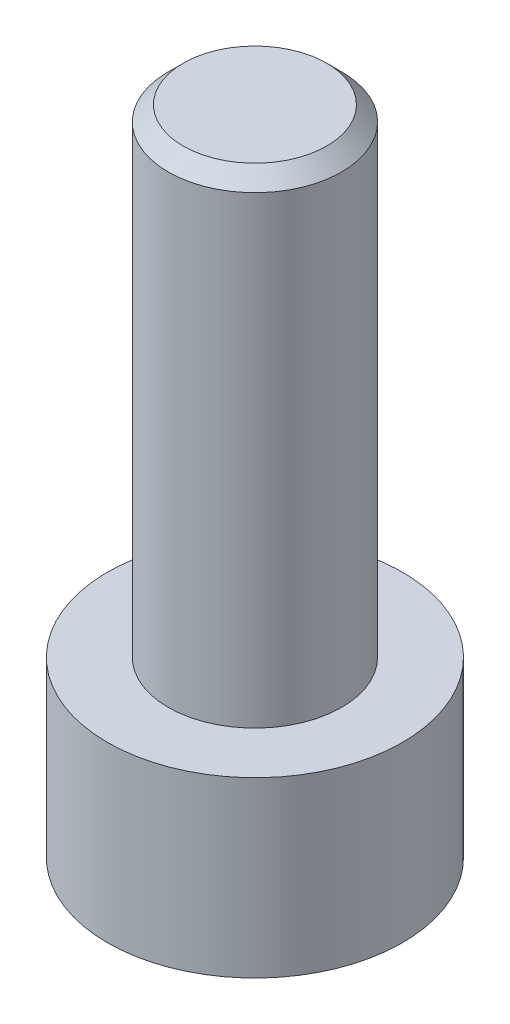
ISO-10303-21;
HEADER;
FILE_DESCRIPTION(('STEP AP214'),'2;1');
FILE_NAME('part.step','',(''),(''),'','','');
FILE_SCHEMA(('AUTOMOTIVE_DESIGN { 1 0 10303 214 1 1 1 1 }'));
ENDSEC;
DATA;
#1=APPLICATION_CONTEXT('core data for automotive mechanical design processes');
#2=APPLICATION_PROTOCOL_DEFINITION('international standard','automotive_design',2000,#1);
#3=PRODUCT_CONTEXT('',#1,'mechanical');
#4=PRODUCT('Part','Part','',(#3));
#5=PRODUCT_RELATED_PRODUCT_CATEGORY('part','',(#4));
#6=PRODUCT_DEFINITION_FORMATION('','',#4);
#7=PRODUCT_DEFINITION_CONTEXT('part definition',#1,'design');
#8=PRODUCT_DEFINITION('design','',#6,#7);
#9=PRODUCT_DEFINITION_SHAPE('','',#8);
#10=(LENGTH_UNIT() NAMED_UNIT(*) SI_UNIT(.MILLI.,.METRE.));
#11=(NAMED_UNIT(*) PLANE_ANGLE_UNIT() SI_UNIT($,.RADIAN.));
#12=(NAMED_UNIT(*) SI_UNIT($,.STERADIAN.) SOLID_ANGLE_UNIT());
#13=UNCERTAINTY_MEASURE_WITH_UNIT(LENGTH_MEASURE(1.E-05),#10,'distance_accuracy_value','');
#14=(GEOMETRIC_REPRESENTATION_CONTEXT(3) GLOBAL_UNCERTAINTY_ASSIGNED_CONTEXT((#13)) GLOBAL_UNIT_ASSIGNED_CONTEXT((#10,
#11,#12)) REPRESENTATION_CONTEXT('',''));
#15=CARTESIAN_POINT('',(0.,0.,0.));
#16=DIRECTION('',(0.,0.,1.));
#17=DIRECTION('',(1.,0.,0.));
#18=AXIS2_PLACEMENT_3D('',#15,#16,#17);
#19=CARTESIAN_POINT('',(0.,2.9,0.));
#20=DIRECTION('',(0.,-1.,0.));
#21=DIRECTION('',(0.,0.,-1.));
#22=AXIS2_PLACEMENT_3D('',#19,#20,#21);
#23=CYLINDRICAL_SURFACE('',#22,2.465);
#24=CARTESIAN_POINT('',(0.,2.9,0.));
#25=DIRECTION('',(0.,1.,0.));
#26=DIRECTION('',(0.,0.,1.));
#27=AXIS2_PLACEMENT_3D('',#24,#25,#26);
#28=CIRCLE('',#27,2.465);
#29=CARTESIAN_POINT('',(0.,2.9,2.465));
#30=VERTEX_POINT('',#29);
#31=EDGE_CURVE('E177',#30,#30,#28,.T.);
#32=ORIENTED_EDGE('',*,*,#31,.F.);
#33=EDGE_LOOP('',(#32));
#34=FACE_BOUND('',#33,.T.);
#35=CARTESIAN_POINT('',(0.,0.,0.));
#36=DIRECTION('',(0.,1.,0.));
#37=DIRECTION('',(0.,0.,1.));
#38=AXIS2_PLACEMENT_3D('',#35,#36,#37);
#39=CIRCLE('',#38,2.465);
#40=CARTESIAN_POINT('',(0.,0.,2.465));
#41=VERTEX_POINT('',#40);
#42=EDGE_CURVE('E163',#41,#41,#39,.T.);
#43=ORIENTED_EDGE('',*,*,#42,.T.);
#44=EDGE_LOOP('',(#43));
#45=FACE_BOUND('',#44,.T.);
#46=ADVANCED_FACE('F47',(#34,#45),#23,.T.);
#47=CARTESIAN_POINT('',(0.,2.9,0.));
#48=DIRECTION('',(0.,1.,0.));
#49=DIRECTION('',(0.,0.,1.));
#50=AXIS2_PLACEMENT_3D('',#47,#48,#49);
#51=PLANE('',#50);
#52=CARTESIAN_POINT('',(0.,2.9,0.));
#53=DIRECTION('',(0.,1.,0.));
#54=DIRECTION('',(0.,0.,1.));
#55=AXIS2_PLACEMENT_3D('',#52,#53,#54);
#56=CIRCLE('',#55,1.45);
#57=CARTESIAN_POINT('',(0.,2.9,1.45));
#58=VERTEX_POINT('',#57);
#59=EDGE_CURVE('E173',#58,#58,#56,.T.);
#60=ORIENTED_EDGE('',*,*,#59,.F.);
#61=EDGE_LOOP('',(#60));
#62=FACE_BOUND('',#61,.T.);
#63=ORIENTED_EDGE('',*,*,#31,.T.);
#64=EDGE_LOOP('',(#63));
#65=FACE_BOUND('',#64,.T.);
#66=ADVANCED_FACE('F199',(#62,#65),#51,.T.);
#67=CARTESIAN_POINT('',(0.,0.,0.));
#68=DIRECTION('',(0.,1.,0.));
#69=DIRECTION('',(0.,0.,1.));
#70=AXIS2_PLACEMENT_3D('',#67,#68,#69);
#71=PLANE('',#70);
#72=DIRECTION('',(0.5,0.,0.866025403784439));
#73=VECTOR('',#72,1.);
#74=CARTESIAN_POINT('',(0.733234841870825,0.,-1.27));
#75=LINE('',#74,#73);
#76=CARTESIAN_POINT('',(0.733234841870825,0.,-1.27));
#77=VERTEX_POINT('',#76);
#78=CARTESIAN_POINT('',(1.46646968374165,0.,0.));
#79=VERTEX_POINT('',#78);
#80=EDGE_CURVE('E144',#77,#79,#75,.T.);
#81=ORIENTED_EDGE('',*,*,#80,.F.);
#82=DIRECTION('',(1.,0.,0.));
#83=VECTOR('',#82,1.);
#84=CARTESIAN_POINT('',(-0.733234841870825,0.,-1.27));
#85=LINE('',#84,#83);
#86=CARTESIAN_POINT('',(-0.733234841870825,0.,-1.27));
#87=VERTEX_POINT('',#86);
#88=EDGE_CURVE('E64',#87,#77,#85,.T.);
#89=ORIENTED_EDGE('',*,*,#88,.F.);
#90=DIRECTION('',(0.5,0.,-0.866025403784438));
#91=VECTOR('',#90,1.);
#92=CARTESIAN_POINT('',(-1.46646968374165,0.,0.));
#93=LINE('',#92,#91);
#94=CARTESIAN_POINT('',(-1.46646968374165,0.,0.));
#95=VERTEX_POINT('',#94);
#96=EDGE_CURVE('E157',#95,#87,#93,.T.);
#97=ORIENTED_EDGE('',*,*,#96,.F.);
#98=DIRECTION('',(-0.5,0.,-0.866025403784439));
#99=VECTOR('',#98,1.);
#100=CARTESIAN_POINT('',(-0.733234841870825,0.,1.27));
#101=LINE('',#100,#99);
#102=CARTESIAN_POINT('',(-0.733234841870825,0.,1.27));
#103=VERTEX_POINT('',#102);
#104=EDGE_CURVE('E154',#103,#95,#101,.T.);
#105=ORIENTED_EDGE('',*,*,#104,.F.);
#106=DIRECTION('',(-1.,0.,0.));
#107=VECTOR('',#106,1.);
#108=CARTESIAN_POINT('',(0.733234841870825,0.,1.27));
#109=LINE('',#108,#107);
#110=CARTESIAN_POINT('',(0.733234841870825,0.,1.27));
#111=VERTEX_POINT('',#110);
#112=EDGE_CURVE('E112',#111,#103,#109,.T.);
#113=ORIENTED_EDGE('',*,*,#112,.F.);
#114=DIRECTION('',(-0.5,0.,0.866025403784439));
#115=VECTOR('',#114,1.);
#116=CARTESIAN_POINT('',(1.46646968374165,0.,0.));
#117=LINE('',#116,#115);
#118=EDGE_CURVE('E148',#79,#111,#117,.T.);
#119=ORIENTED_EDGE('',*,*,#118,.F.);
#120=EDGE_LOOP('',(#81,#89,#97,#105,#113,#119));
#121=FACE_BOUND('',#120,.T.);
#122=ORIENTED_EDGE('',*,*,#42,.F.);
#123=EDGE_LOOP('',(#122));
#124=FACE_BOUND('',#123,.T.);
#125=ADVANCED_FACE('F204',(#121,#124),#71,.F.);
#126=CARTESIAN_POINT('',(0.,10.9,0.));
#127=DIRECTION('',(0.,-1.,0.));
#128=DIRECTION('',(0.,0.,-1.));
#129=AXIS2_PLACEMENT_3D('',#126,#127,#128);
#130=CYLINDRICAL_SURFACE('',#129,1.45);
#131=CARTESIAN_POINT('',(0.,10.65,0.));
#132=DIRECTION('',(0.,1.,0.));
#133=DIRECTION('',(0.,0.,1.));
#134=AXIS2_PLACEMENT_3D('',#131,#132,#133);
#135=CIRCLE('',#134,1.45);
#136=CARTESIAN_POINT('',(0.,10.65,1.45));
#137=VERTEX_POINT('',#136);
#138=EDGE_CURVE('E11',#137,#137,#135,.F.);
#139=ORIENTED_EDGE('',*,*,#138,.T.);
#140=EDGE_LOOP('',(#139));
#141=FACE_BOUND('',#140,.T.);
#142=ORIENTED_EDGE('',*,*,#59,.T.);
#143=EDGE_LOOP('',(#142));
#144=FACE_BOUND('',#143,.T.);
#145=ADVANCED_FACE('F211',(#141,#144),#130,.T.);
#146=CARTESIAN_POINT('',(0.,10.9,0.));
#147=DIRECTION('',(0.,1.,0.));
#148=DIRECTION('',(0.,0.,1.));
#149=AXIS2_PLACEMENT_3D('',#146,#147,#148);
#150=PLANE('',#149);
#151=CARTESIAN_POINT('',(0.,10.9,0.));
#152=DIRECTION('',(0.,1.,0.));
#153=DIRECTION('',(0.,0.,1.));
#154=AXIS2_PLACEMENT_3D('',#151,#152,#153);
#155=CIRCLE('',#154,1.2);
#156=CARTESIAN_POINT('',(0.,10.9,1.2));
#157=VERTEX_POINT('',#156);
#158=EDGE_CURVE('E57',#157,#157,#155,.T.);
#159=ORIENTED_EDGE('',*,*,#158,.T.);
#160=EDGE_LOOP('',(#159));
#161=FACE_BOUND('',#160,.T.);
#162=ADVANCED_FACE('F187',(#161),#150,.T.);
#163=CARTESIAN_POINT('',(-0.733234841870825,1.9,-1.27));
#164=DIRECTION('',(0.,0.,-1.));
#165=DIRECTION('',(-1.,0.,0.));
#166=AXIS2_PLACEMENT_3D('',#163,#164,#165);
#167=PLANE('',#166);
#168=ORIENTED_EDGE('',*,*,#88,.T.);
#169=DIRECTION('',(0.,-1.,0.));
#170=VECTOR('',#169,1.);
#171=CARTESIAN_POINT('',(0.733234841870825,1.9,-1.27));
#172=LINE('',#171,#170);
#173=CARTESIAN_POINT('',(0.733234841870825,1.9,-1.27));
#174=VERTEX_POINT('',#173);
#175=EDGE_CURVE('E94',#174,#77,#172,.T.);
#176=ORIENTED_EDGE('',*,*,#175,.F.);
#177=DIRECTION('',(1.,0.,0.));
#178=VECTOR('',#177,1.);
#179=CARTESIAN_POINT('',(-0.733234841870825,1.9,-1.27));
#180=LINE('',#179,#178);
#181=CARTESIAN_POINT('',(-0.733234841870825,1.9,-1.27));
#182=VERTEX_POINT('',#181);
#183=EDGE_CURVE('E160',#182,#174,#180,.T.);
#184=ORIENTED_EDGE('',*,*,#183,.F.);
#185=DIRECTION('',(0.,-1.,0.));
#186=VECTOR('',#185,1.);
#187=CARTESIAN_POINT('',(-0.733234841870825,1.9,-1.27));
#188=LINE('',#187,#186);
#189=EDGE_CURVE('E72',#182,#87,#188,.T.);
#190=ORIENTED_EDGE('',*,*,#189,.T.);
#191=EDGE_LOOP('',(#168,#176,#184,#190));
#192=FACE_BOUND('',#191,.T.);
#193=ADVANCED_FACE('F218',(#192),#167,.F.);
#194=CARTESIAN_POINT('',(-1.46646968374165,1.9,0.));
#195=DIRECTION('',(-0.866025403784439,0.,-0.5));
#196=DIRECTION('',(-0.5,0.,0.866025403784439));
#197=AXIS2_PLACEMENT_3D('',#194,#195,#196);
#198=PLANE('',#197);
#199=ORIENTED_EDGE('',*,*,#96,.T.);
#200=ORIENTED_EDGE('',*,*,#189,.F.);
#201=DIRECTION('',(0.5,0.,-0.866025403784438));
#202=VECTOR('',#201,1.);
#203=CARTESIAN_POINT('',(-1.46646968374165,1.9,0.));
#204=LINE('',#203,#202);
#205=CARTESIAN_POINT('',(-1.46646968374165,1.9,0.));
#206=VERTEX_POINT('',#205);
#207=EDGE_CURVE('E126',#206,#182,#204,.T.);
#208=ORIENTED_EDGE('',*,*,#207,.F.);
#209=DIRECTION('',(0.,-1.,0.));
#210=VECTOR('',#209,1.);
#211=CARTESIAN_POINT('',(-1.46646968374165,1.9,0.));
#212=LINE('',#211,#210);
#213=EDGE_CURVE('E117',#206,#95,#212,.T.);
#214=ORIENTED_EDGE('',*,*,#213,.T.);
#215=EDGE_LOOP('',(#199,#200,#208,#214));
#216=FACE_BOUND('',#215,.T.);
#217=ADVANCED_FACE('F221',(#216),#198,.F.);
#218=CARTESIAN_POINT('',(-0.733234841870825,1.9,1.27));
#219=DIRECTION('',(-0.866025403784438,0.,0.5));
#220=DIRECTION('',(0.5,0.,0.866025403784439));
#221=AXIS2_PLACEMENT_3D('',#218,#219,#220);
#222=PLANE('',#221);
#223=ORIENTED_EDGE('',*,*,#104,.T.);
#224=ORIENTED_EDGE('',*,*,#213,.F.);
#225=DIRECTION('',(-0.5,0.,-0.866025403784439));
#226=VECTOR('',#225,1.);
#227=CARTESIAN_POINT('',(-0.733234841870825,1.9,1.27));
#228=LINE('',#227,#226);
#229=CARTESIAN_POINT('',(-0.733234841870825,1.9,1.27));
#230=VERTEX_POINT('',#229);
#231=EDGE_CURVE('E121',#230,#206,#228,.T.);
#232=ORIENTED_EDGE('',*,*,#231,.F.);
#233=DIRECTION('',(0.,-1.,0.));
#234=VECTOR('',#233,1.);
#235=CARTESIAN_POINT('',(-0.733234841870825,1.9,1.27));
#236=LINE('',#235,#234);
#237=EDGE_CURVE('E105',#230,#103,#236,.T.);
#238=ORIENTED_EDGE('',*,*,#237,.T.);
#239=EDGE_LOOP('',(#223,#224,#232,#238));
#240=FACE_BOUND('',#239,.T.);
#241=ADVANCED_FACE('F122',(#240),#222,.F.);
#242=CARTESIAN_POINT('',(0.733234841870825,1.9,1.27));
#243=DIRECTION('',(0.,0.,1.));
#244=DIRECTION('',(1.,0.,0.));
#245=AXIS2_PLACEMENT_3D('',#242,#243,#244);
#246=PLANE('',#245);
#247=ORIENTED_EDGE('',*,*,#112,.T.);
#248=ORIENTED_EDGE('',*,*,#237,.F.);
#249=DIRECTION('',(-1.,0.,0.));
#250=VECTOR('',#249,1.);
#251=CARTESIAN_POINT('',(0.733234841870825,1.9,1.27));
#252=LINE('',#251,#250);
#253=CARTESIAN_POINT('',(0.733234841870825,1.9,1.27));
#254=VERTEX_POINT('',#253);
#255=EDGE_CURVE('E109',#254,#230,#252,.T.);
#256=ORIENTED_EDGE('',*,*,#255,.F.);
#257=DIRECTION('',(0.,-1.,0.));
#258=VECTOR('',#257,1.);
#259=CARTESIAN_POINT('',(0.733234841870825,1.9,1.27));
#260=LINE('',#259,#258);
#261=EDGE_CURVE('E118',#254,#111,#260,.T.);
#262=ORIENTED_EDGE('',*,*,#261,.T.);
#263=EDGE_LOOP('',(#247,#248,#256,#262));
#264=FACE_BOUND('',#263,.T.);
#265=ADVANCED_FACE('F107',(#264),#246,.F.);
#266=CARTESIAN_POINT('',(1.46646968374165,1.9,0.));
#267=DIRECTION('',(0.866025403784438,0.,0.5));
#268=DIRECTION('',(0.5,0.,-0.866025403784439));
#269=AXIS2_PLACEMENT_3D('',#266,#267,#268);
#270=PLANE('',#269);
#271=ORIENTED_EDGE('',*,*,#118,.T.);
#272=ORIENTED_EDGE('',*,*,#261,.F.);
#273=DIRECTION('',(-0.5,0.,0.866025403784439));
#274=VECTOR('',#273,1.);
#275=CARTESIAN_POINT('',(1.46646968374165,1.9,0.));
#276=LINE('',#275,#274);
#277=CARTESIAN_POINT('',(1.46646968374165,1.9,0.));
#278=VERTEX_POINT('',#277);
#279=EDGE_CURVE('E132',#278,#254,#276,.T.);
#280=ORIENTED_EDGE('',*,*,#279,.F.);
#281=DIRECTION('',(0.,-1.,0.));
#282=VECTOR('',#281,1.);
#283=CARTESIAN_POINT('',(1.46646968374165,1.9,0.));
#284=LINE('',#283,#282);
#285=EDGE_CURVE('E168',#278,#79,#284,.T.);
#286=ORIENTED_EDGE('',*,*,#285,.T.);
#287=EDGE_LOOP('',(#271,#272,#280,#286));
#288=FACE_BOUND('',#287,.T.);
#289=ADVANCED_FACE('F224',(#288),#270,.F.);
#290=CARTESIAN_POINT('',(0.733234841870825,1.9,-1.27));
#291=DIRECTION('',(0.866025403784438,0.,-0.5));
#292=DIRECTION('',(-0.5,0.,-0.866025403784439));
#293=AXIS2_PLACEMENT_3D('',#290,#291,#292);
#294=PLANE('',#293);
#295=ORIENTED_EDGE('',*,*,#80,.T.);
#296=ORIENTED_EDGE('',*,*,#285,.F.);
#297=DIRECTION('',(0.5,0.,0.866025403784439));
#298=VECTOR('',#297,1.);
#299=CARTESIAN_POINT('',(0.733234841870825,1.9,-1.27));
#300=LINE('',#299,#298);
#301=EDGE_CURVE('E136',#174,#278,#300,.T.);
#302=ORIENTED_EDGE('',*,*,#301,.F.);
#303=ORIENTED_EDGE('',*,*,#175,.T.);
#304=EDGE_LOOP('',(#295,#296,#302,#303));
#305=FACE_BOUND('',#304,.T.);
#306=ADVANCED_FACE('F195',(#305),#294,.F.);
#307=CARTESIAN_POINT('',(0.,1.9,0.));
#308=DIRECTION('',(0.,-1.,0.));
#309=DIRECTION('',(0.,0.,-1.));
#310=AXIS2_PLACEMENT_3D('',#307,#308,#309);
#311=PLANE('',#310);
#312=ORIENTED_EDGE('',*,*,#183,.T.);
#313=ORIENTED_EDGE('',*,*,#301,.T.);
#314=ORIENTED_EDGE('',*,*,#279,.T.);
#315=ORIENTED_EDGE('',*,*,#255,.T.);
#316=ORIENTED_EDGE('',*,*,#231,.T.);
#317=ORIENTED_EDGE('',*,*,#207,.T.);
#318=EDGE_LOOP('',(#312,#313,#314,#315,#316,#317));
#319=FACE_BOUND('',#318,.T.);
#320=ADVANCED_FACE('F129',(#319),#311,.T.);
#321=CARTESIAN_POINT('',(0.,10.9,0.));
#322=DIRECTION('',(0.,-1.,0.));
#323=DIRECTION('',(0.,0.,-1.));
#324=AXIS2_PLACEMENT_3D('',#321,#322,#323);
#325=CONICAL_SURFACE('',#324,1.2,0.785398163397448);
#326=ORIENTED_EDGE('',*,*,#138,.F.);
#327=EDGE_LOOP('',(#326));
#328=FACE_BOUND('',#327,.T.);
#329=ORIENTED_EDGE('',*,*,#158,.F.);
#330=EDGE_LOOP('',(#329));
#331=FACE_BOUND('',#330,.T.);
#332=ADVANCED_FACE('F50',(#328,#331),#325,.T.);
#333=CLOSED_SHELL('',(#46,#66,#125,#145,#162,#193,#217,#241,#265,#289,#306,#320,#332));
#334=MANIFOLD_SOLID_BREP('B2',#333);
#335=ADVANCED_BREP_SHAPE_REPRESENTATION('',(#18,#334),#14);
#336=SHAPE_DEFINITION_REPRESENTATION(#9,#335);
ENDSEC;
END-ISO-10303-21;
